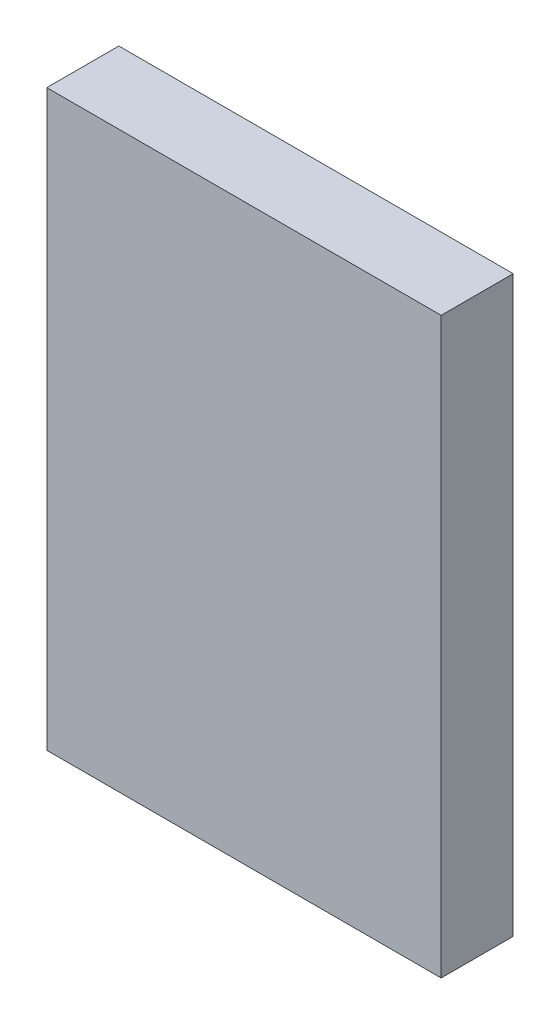
ISO-10303-21;
HEADER;
FILE_DESCRIPTION(('STEP AP214'),'2;1');
FILE_NAME('part.step','',(''),(''),'','','');
FILE_SCHEMA(('AUTOMOTIVE_DESIGN { 1 0 10303 214 1 1 1 1 }'));
ENDSEC;
DATA;
#1=APPLICATION_CONTEXT('core data for automotive mechanical design processes');
#2=APPLICATION_PROTOCOL_DEFINITION('international standard','automotive_design',2000,#1);
#3=PRODUCT_CONTEXT('',#1,'mechanical');
#4=PRODUCT('Part','Part','',(#3));
#5=PRODUCT_RELATED_PRODUCT_CATEGORY('part','',(#4));
#6=PRODUCT_DEFINITION_FORMATION('','',#4);
#7=PRODUCT_DEFINITION_CONTEXT('part definition',#1,'design');
#8=PRODUCT_DEFINITION('design','',#6,#7);
#9=PRODUCT_DEFINITION_SHAPE('','',#8);
#10=(LENGTH_UNIT() NAMED_UNIT(*) SI_UNIT(.MILLI.,.METRE.));
#11=(NAMED_UNIT(*) PLANE_ANGLE_UNIT() SI_UNIT($,.RADIAN.));
#12=(NAMED_UNIT(*) SI_UNIT($,.STERADIAN.) SOLID_ANGLE_UNIT());
#13=UNCERTAINTY_MEASURE_WITH_UNIT(LENGTH_MEASURE(1.E-05),#10,'distance_accuracy_value','');
#14=(GEOMETRIC_REPRESENTATION_CONTEXT(3) GLOBAL_UNCERTAINTY_ASSIGNED_CONTEXT((#13)) GLOBAL_UNIT_ASSIGNED_CONTEXT((#10,
#11,#12)) REPRESENTATION_CONTEXT('',''));
#15=CARTESIAN_POINT('',(0.,0.,0.));
#16=DIRECTION('',(0.,0.,1.));
#17=DIRECTION('',(1.,0.,0.));
#18=AXIS2_PLACEMENT_3D('',#15,#16,#17);
#19=CARTESIAN_POINT('',(0.775,-1.549,0.));
#20=DIRECTION('',(0.,-1.,0.));
#21=DIRECTION('',(0.,0.,-1.));
#22=AXIS2_PLACEMENT_3D('',#19,#20,#21);
#23=PLANE('',#22);
#24=DIRECTION('',(-1.,0.,0.));
#25=VECTOR('',#24,1.);
#26=CARTESIAN_POINT('',(1.054,-1.549,0.));
#27=LINE('',#26,#25);
#28=CARTESIAN_POINT('',(1.054,-1.549,0.));
#29=VERTEX_POINT('',#28);
#30=CARTESIAN_POINT('',(0.775,-1.549,0.));
#31=VERTEX_POINT('',#30);
#32=EDGE_CURVE('E11',#29,#31,#27,.T.);
#33=ORIENTED_EDGE('',*,*,#32,.F.);
#34=DIRECTION('',(0.,0.,-1.));
#35=VECTOR('',#34,1.);
#36=CARTESIAN_POINT('',(1.054,-1.549,0.051));
#37=LINE('',#36,#35);
#38=CARTESIAN_POINT('',(1.054,-1.549,0.051));
#39=VERTEX_POINT('',#38);
#40=EDGE_CURVE('E24',#39,#29,#37,.T.);
#41=ORIENTED_EDGE('',*,*,#40,.F.);
#42=DIRECTION('',(1.,0.,0.));
#43=VECTOR('',#42,1.);
#44=CARTESIAN_POINT('',(0.775,-1.549,0.051));
#45=LINE('',#44,#43);
#46=CARTESIAN_POINT('',(0.775,-1.549,0.051));
#47=VERTEX_POINT('',#46);
#48=EDGE_CURVE('E88',#47,#39,#45,.T.);
#49=ORIENTED_EDGE('',*,*,#48,.F.);
#50=DIRECTION('',(0.,0.,1.));
#51=VECTOR('',#50,1.);
#52=CARTESIAN_POINT('',(0.775,-1.549,0.));
#53=LINE('',#52,#51);
#54=EDGE_CURVE('E77',#31,#47,#53,.T.);
#55=ORIENTED_EDGE('',*,*,#54,.F.);
#56=EDGE_LOOP('',(#33,#41,#49,#55));
#57=FACE_BOUND('',#56,.T.);
#58=ADVANCED_FACE('F17',(#57),#23,.T.);
#59=CARTESIAN_POINT('',(1.054,-1.549,0.));
#60=DIRECTION('',(1.,0.,0.));
#61=DIRECTION('',(0.,1.,0.));
#62=AXIS2_PLACEMENT_3D('',#59,#60,#61);
#63=PLANE('',#62);
#64=DIRECTION('',(0.,-1.,0.));
#65=VECTOR('',#64,1.);
#66=CARTESIAN_POINT('',(1.054,-1.143,0.));
#67=LINE('',#66,#65);
#68=CARTESIAN_POINT('',(1.054,-1.143,0.));
#69=VERTEX_POINT('',#68);
#70=EDGE_CURVE('E85',#69,#29,#67,.T.);
#71=ORIENTED_EDGE('',*,*,#70,.F.);
#72=DIRECTION('',(0.,0.,-1.));
#73=VECTOR('',#72,1.);
#74=CARTESIAN_POINT('',(1.054,-1.143,0.051));
#75=LINE('',#74,#73);
#76=CARTESIAN_POINT('',(1.054,-1.143,0.051));
#77=VERTEX_POINT('',#76);
#78=EDGE_CURVE('E83',#77,#69,#75,.T.);
#79=ORIENTED_EDGE('',*,*,#78,.F.);
#80=DIRECTION('',(0.,1.,0.));
#81=VECTOR('',#80,1.);
#82=CARTESIAN_POINT('',(1.054,-1.549,0.051));
#83=LINE('',#82,#81);
#84=EDGE_CURVE('E72',#39,#77,#83,.T.);
#85=ORIENTED_EDGE('',*,*,#84,.F.);
#86=ORIENTED_EDGE('',*,*,#40,.T.);
#87=EDGE_LOOP('',(#71,#79,#85,#86));
#88=FACE_BOUND('',#87,.T.);
#89=ADVANCED_FACE('F90',(#88),#63,.T.);
#90=CARTESIAN_POINT('',(1.054,-1.143,0.));
#91=DIRECTION('',(0.,1.,0.));
#92=DIRECTION('',(1.,0.,0.));
#93=AXIS2_PLACEMENT_3D('',#90,#91,#92);
#94=PLANE('',#93);
#95=DIRECTION('',(1.,0.,0.));
#96=VECTOR('',#95,1.);
#97=CARTESIAN_POINT('',(0.775,-1.143,0.));
#98=LINE('',#97,#96);
#99=CARTESIAN_POINT('',(0.775,-1.143,0.));
#100=VERTEX_POINT('',#99);
#101=EDGE_CURVE('E60',#100,#69,#98,.T.);
#102=ORIENTED_EDGE('',*,*,#101,.F.);
#103=DIRECTION('',(0.,0.,-1.));
#104=VECTOR('',#103,1.);
#105=CARTESIAN_POINT('',(0.775,-1.143,0.051));
#106=LINE('',#105,#104);
#107=CARTESIAN_POINT('',(0.775,-1.143,0.051));
#108=VERTEX_POINT('',#107);
#109=EDGE_CURVE('E54',#108,#100,#106,.T.);
#110=ORIENTED_EDGE('',*,*,#109,.F.);
#111=DIRECTION('',(-1.,0.,0.));
#112=VECTOR('',#111,1.);
#113=CARTESIAN_POINT('',(1.054,-1.143,0.051));
#114=LINE('',#113,#112);
#115=EDGE_CURVE('E58',#77,#108,#114,.T.);
#116=ORIENTED_EDGE('',*,*,#115,.F.);
#117=ORIENTED_EDGE('',*,*,#78,.T.);
#118=EDGE_LOOP('',(#102,#110,#116,#117));
#119=FACE_BOUND('',#118,.T.);
#120=ADVANCED_FACE('F56',(#119),#94,.T.);
#121=CARTESIAN_POINT('',(0.775,-1.143,0.));
#122=DIRECTION('',(-1.,0.,0.));
#123=DIRECTION('',(0.,0.,1.));
#124=AXIS2_PLACEMENT_3D('',#121,#122,#123);
#125=PLANE('',#124);
#126=DIRECTION('',(0.,1.,0.));
#127=VECTOR('',#126,1.);
#128=CARTESIAN_POINT('',(0.775,-1.549,0.));
#129=LINE('',#128,#127);
#130=EDGE_CURVE('E73',#31,#100,#129,.T.);
#131=ORIENTED_EDGE('',*,*,#130,.F.);
#132=ORIENTED_EDGE('',*,*,#54,.T.);
#133=DIRECTION('',(0.,-1.,0.));
#134=VECTOR('',#133,1.);
#135=CARTESIAN_POINT('',(0.775,-1.143,0.051));
#136=LINE('',#135,#134);
#137=EDGE_CURVE('E70',#108,#47,#136,.T.);
#138=ORIENTED_EDGE('',*,*,#137,.F.);
#139=ORIENTED_EDGE('',*,*,#109,.T.);
#140=EDGE_LOOP('',(#131,#132,#138,#139));
#141=FACE_BOUND('',#140,.T.);
#142=ADVANCED_FACE('F76',(#141),#125,.T.);
#143=CARTESIAN_POINT('',(0.775,-1.143,0.));
#144=DIRECTION('',(0.,0.,-1.));
#145=DIRECTION('',(0.,-1.,0.));
#146=AXIS2_PLACEMENT_3D('',#143,#144,#145);
#147=PLANE('',#146);
#148=ORIENTED_EDGE('',*,*,#101,.T.);
#149=ORIENTED_EDGE('',*,*,#70,.T.);
#150=ORIENTED_EDGE('',*,*,#32,.T.);
#151=ORIENTED_EDGE('',*,*,#130,.T.);
#152=EDGE_LOOP('',(#148,#149,#150,#151));
#153=FACE_BOUND('',#152,.T.);
#154=ADVANCED_FACE('F91',(#153),#147,.T.);
#155=CARTESIAN_POINT('',(0.775,-1.549,0.051));
#156=DIRECTION('',(0.,0.,1.));
#157=DIRECTION('',(1.,0.,0.));
#158=AXIS2_PLACEMENT_3D('',#155,#156,#157);
#159=PLANE('',#158);
#160=ORIENTED_EDGE('',*,*,#48,.T.);
#161=ORIENTED_EDGE('',*,*,#84,.T.);
#162=ORIENTED_EDGE('',*,*,#115,.T.);
#163=ORIENTED_EDGE('',*,*,#137,.T.);
#164=EDGE_LOOP('',(#160,#161,#162,#163));
#165=FACE_BOUND('',#164,.T.);
#166=ADVANCED_FACE('F69',(#165),#159,.T.);
#167=CLOSED_SHELL('',(#58,#89,#120,#142,#154,#166));
#168=MANIFOLD_SOLID_BREP('B1',#167);
#169=ADVANCED_BREP_SHAPE_REPRESENTATION('',(#18,#168),#14);
#170=SHAPE_DEFINITION_REPRESENTATION(#9,#169);
ENDSEC;
END-ISO-10303-21;
